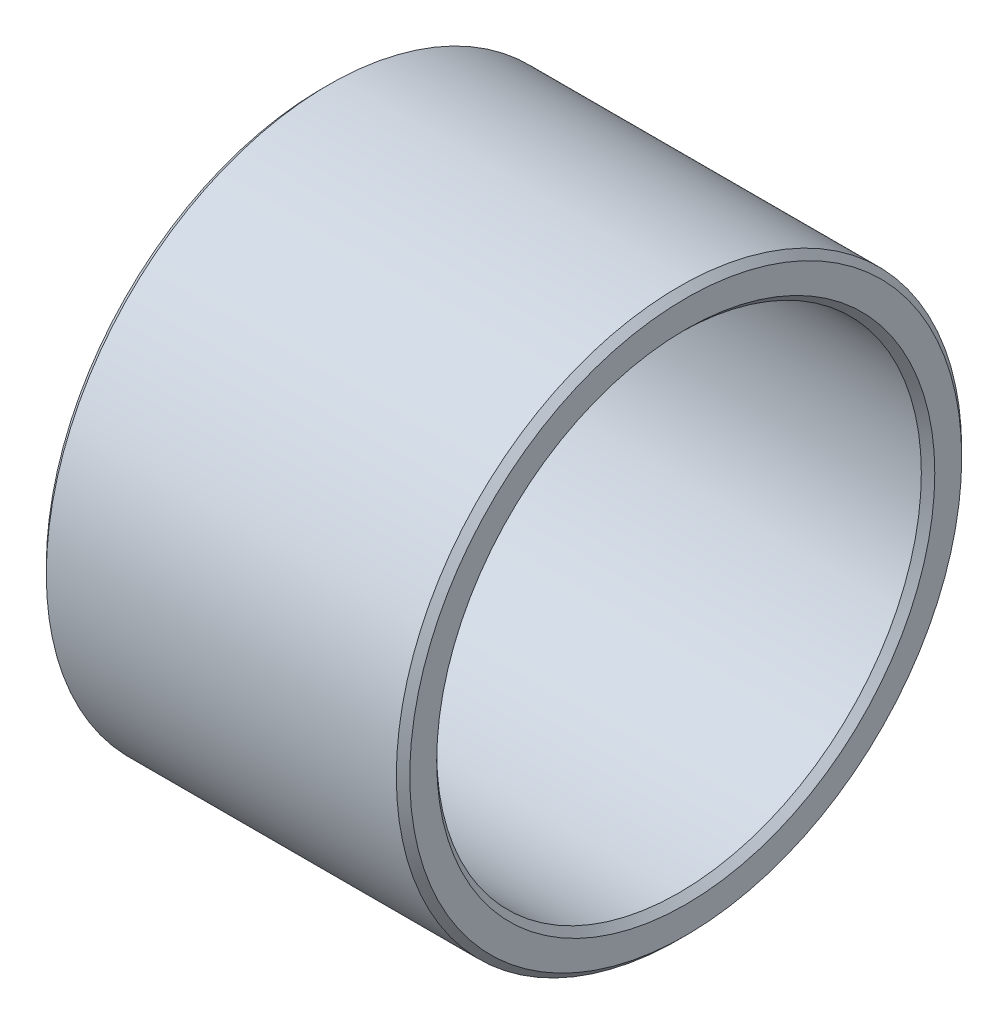
ISO-10303-21;
HEADER;
FILE_DESCRIPTION(('STEP AP214'),'2;1');
FILE_NAME('part.step','',(''),(''),'','','');
FILE_SCHEMA(('AUTOMOTIVE_DESIGN { 1 0 10303 214 1 1 1 1 }'));
ENDSEC;
DATA;
#1=APPLICATION_CONTEXT('core data for automotive mechanical design processes');
#2=APPLICATION_PROTOCOL_DEFINITION('international standard','automotive_design',2000,#1);
#3=PRODUCT_CONTEXT('',#1,'mechanical');
#4=PRODUCT('Part','Part','',(#3));
#5=PRODUCT_RELATED_PRODUCT_CATEGORY('part','',(#4));
#6=PRODUCT_DEFINITION_FORMATION('','',#4);
#7=PRODUCT_DEFINITION_CONTEXT('part definition',#1,'design');
#8=PRODUCT_DEFINITION('design','',#6,#7);
#9=PRODUCT_DEFINITION_SHAPE('','',#8);
#10=(LENGTH_UNIT() NAMED_UNIT(*) SI_UNIT(.MILLI.,.METRE.));
#11=(NAMED_UNIT(*) PLANE_ANGLE_UNIT() SI_UNIT($,.RADIAN.));
#12=(NAMED_UNIT(*) SI_UNIT($,.STERADIAN.) SOLID_ANGLE_UNIT());
#13=UNCERTAINTY_MEASURE_WITH_UNIT(LENGTH_MEASURE(1.E-05),#10,'distance_accuracy_value','');
#14=(GEOMETRIC_REPRESENTATION_CONTEXT(3) GLOBAL_UNCERTAINTY_ASSIGNED_CONTEXT((#13)) GLOBAL_UNIT_ASSIGNED_CONTEXT((#10,
#11,#12)) REPRESENTATION_CONTEXT('',''));
#15=CARTESIAN_POINT('',(0.,0.,0.));
#16=DIRECTION('',(0.,0.,1.));
#17=DIRECTION('',(1.,0.,0.));
#18=AXIS2_PLACEMENT_3D('',#15,#16,#17);
#19=CARTESIAN_POINT('',(-63.2450777037237,-0.830553033493768,57.3794442447024));
#20=DIRECTION('',(-1.,0.,0.));
#21=DIRECTION('',(0.,0.,1.));
#22=AXIS2_PLACEMENT_3D('',#19,#20,#21);
#23=PLANE('',#22);
#24=CARTESIAN_POINT('',(-63.2450777037237,-0.762059862336083,78.3793325464419));
#25=DIRECTION('',(-1.,0.,0.));
#26=DIRECTION('',(0.,0.,1.));
#27=AXIS2_PLACEMENT_3D('',#24,#25,#26);
#28=CIRCLE('',#27,20.5000000000007);
#29=CARTESIAN_POINT('',(-63.2450777037237,-0.762059862336083,98.8793325464426));
#30=VERTEX_POINT('',#29);
#31=EDGE_CURVE('E58',#30,#30,#28,.T.);
#32=ORIENTED_EDGE('',*,*,#31,.T.);
#33=EDGE_LOOP('',(#32));
#34=FACE_BOUND('',#33,.T.);
#35=CARTESIAN_POINT('',(-63.2450777037237,-0.762059862336083,78.3793325464419));
#36=DIRECTION('',(-1.,0.,0.));
#37=DIRECTION('',(0.,0.,1.));
#38=AXIS2_PLACEMENT_3D('',#35,#36,#37);
#39=CIRCLE('',#38,18.5000000000006);
#40=CARTESIAN_POINT('',(-63.2450777037237,-0.762059862336083,96.8793325464425));
#41=VERTEX_POINT('',#40);
#42=EDGE_CURVE('E61',#41,#41,#39,.F.);
#43=ORIENTED_EDGE('',*,*,#42,.T.);
#44=EDGE_LOOP('',(#43));
#45=FACE_BOUND('',#44,.T.);
#46=ADVANCED_FACE('F32',(#34,#45),#23,.T.);
#47=CARTESIAN_POINT('',(-153.375983394243,-0.762059862336083,78.3793325464419));
#48=DIRECTION('',(-1.,0.,0.));
#49=DIRECTION('',(0.,0.,1.));
#50=AXIS2_PLACEMENT_3D('',#47,#48,#49);
#51=CYLINDRICAL_SURFACE('',#50,18.0000000000006);
#52=CARTESIAN_POINT('',(-62.7450777037237,-0.762059862336083,78.3793325464419));
#53=DIRECTION('',(-1.,0.,0.));
#54=DIRECTION('',(0.,0.,1.));
#55=AXIS2_PLACEMENT_3D('',#52,#53,#54);
#56=CIRCLE('',#55,18.0000000000006);
#57=CARTESIAN_POINT('',(-62.7450777037237,-0.762059862336083,96.3793325464425));
#58=VERTEX_POINT('',#57);
#59=EDGE_CURVE('E43',#58,#58,#56,.T.);
#60=ORIENTED_EDGE('',*,*,#59,.T.);
#61=EDGE_LOOP('',(#60));
#62=FACE_BOUND('',#61,.T.);
#63=CARTESIAN_POINT('',(-36.7450777037235,-0.762059862336083,78.3793325464419));
#64=DIRECTION('',(1.,0.,0.));
#65=DIRECTION('',(0.,0.,-1.));
#66=AXIS2_PLACEMENT_3D('',#63,#64,#65);
#67=CIRCLE('',#66,18.0000000000006);
#68=CARTESIAN_POINT('',(-36.7450777037235,-0.762059862336083,60.3793325464413));
#69=VERTEX_POINT('',#68);
#70=EDGE_CURVE('E47',#69,#69,#67,.T.);
#71=ORIENTED_EDGE('',*,*,#70,.T.);
#72=EDGE_LOOP('',(#71));
#73=FACE_BOUND('',#72,.T.);
#74=ADVANCED_FACE('F74',(#62,#73),#51,.F.);
#75=CARTESIAN_POINT('',(-36.2450777037235,-0.830553033493768,57.3794442447024));
#76=DIRECTION('',(1.,0.,0.));
#77=DIRECTION('',(0.,0.,-1.));
#78=AXIS2_PLACEMENT_3D('',#75,#76,#77);
#79=PLANE('',#78);
#80=CARTESIAN_POINT('',(-36.2450777037235,-0.762059862336083,78.3793325464419));
#81=DIRECTION('',(1.,0.,0.));
#82=DIRECTION('',(0.,0.,-1.));
#83=AXIS2_PLACEMENT_3D('',#80,#81,#82);
#84=CIRCLE('',#83,18.5000000000006);
#85=CARTESIAN_POINT('',(-36.2450777037235,-0.762059862336083,59.8793325464413));
#86=VERTEX_POINT('',#85);
#87=EDGE_CURVE('E10',#86,#86,#84,.F.);
#88=ORIENTED_EDGE('',*,*,#87,.T.);
#89=EDGE_LOOP('',(#88));
#90=FACE_BOUND('',#89,.T.);
#91=CARTESIAN_POINT('',(-36.2450777037235,-0.762059862336083,78.3793325464419));
#92=DIRECTION('',(1.,0.,0.));
#93=DIRECTION('',(0.,0.,-1.));
#94=AXIS2_PLACEMENT_3D('',#91,#92,#93);
#95=CIRCLE('',#94,20.5000000000007);
#96=CARTESIAN_POINT('',(-36.2450777037235,-0.762059862336083,57.8793325464412));
#97=VERTEX_POINT('',#96);
#98=EDGE_CURVE('E39',#97,#97,#95,.T.);
#99=ORIENTED_EDGE('',*,*,#98,.T.);
#100=EDGE_LOOP('',(#99));
#101=FACE_BOUND('',#100,.T.);
#102=ADVANCED_FACE('F77',(#90,#101),#79,.T.);
#103=CARTESIAN_POINT('',(-153.375983394243,-0.762059862336083,78.3793325464419));
#104=DIRECTION('',(-1.,0.,0.));
#105=DIRECTION('',(0.,0.,1.));
#106=AXIS2_PLACEMENT_3D('',#103,#104,#105);
#107=CYLINDRICAL_SURFACE('',#106,21.0000000000007);
#108=CARTESIAN_POINT('',(-62.7450777037237,-0.762059862336083,78.3793325464419));
#109=DIRECTION('',(-1.,0.,0.));
#110=DIRECTION('',(0.,0.,1.));
#111=AXIS2_PLACEMENT_3D('',#108,#109,#110);
#112=CIRCLE('',#111,21.0000000000007);
#113=CARTESIAN_POINT('',(-62.7450777037237,-0.762059862336083,99.3793325464426));
#114=VERTEX_POINT('',#113);
#115=EDGE_CURVE('E52',#114,#114,#112,.F.);
#116=ORIENTED_EDGE('',*,*,#115,.T.);
#117=EDGE_LOOP('',(#116));
#118=FACE_BOUND('',#117,.T.);
#119=CARTESIAN_POINT('',(-36.7450777037235,-0.762059862336083,78.3793325464419));
#120=DIRECTION('',(1.,0.,0.));
#121=DIRECTION('',(0.,0.,-1.));
#122=AXIS2_PLACEMENT_3D('',#119,#120,#121);
#123=CIRCLE('',#122,21.0000000000007);
#124=CARTESIAN_POINT('',(-36.7450777037235,-0.762059862336083,57.3793325464412));
#125=VERTEX_POINT('',#124);
#126=EDGE_CURVE('E55',#125,#125,#123,.F.);
#127=ORIENTED_EDGE('',*,*,#126,.T.);
#128=EDGE_LOOP('',(#127));
#129=FACE_BOUND('',#128,.T.);
#130=ADVANCED_FACE('F95',(#118,#129),#107,.T.);
#131=CARTESIAN_POINT('',(-63.2450777037237,-0.762059862336083,78.3793325464419));
#132=DIRECTION('',(1.,0.,0.));
#133=DIRECTION('',(0.,0.,-1.));
#134=AXIS2_PLACEMENT_3D('',#131,#132,#133);
#135=CONICAL_SURFACE('',#134,20.5000000000007,0.785398163397455);
#136=ORIENTED_EDGE('',*,*,#115,.F.);
#137=EDGE_LOOP('',(#136));
#138=FACE_BOUND('',#137,.T.);
#139=ORIENTED_EDGE('',*,*,#31,.F.);
#140=EDGE_LOOP('',(#139));
#141=FACE_BOUND('',#140,.T.);
#142=ADVANCED_FACE('F70',(#138,#141),#135,.T.);
#143=CARTESIAN_POINT('',(-62.7450777037237,-0.762059862336083,78.3793325464419));
#144=DIRECTION('',(-1.,0.,0.));
#145=DIRECTION('',(0.,0.,1.));
#146=AXIS2_PLACEMENT_3D('',#143,#144,#145);
#147=CONICAL_SURFACE('',#146,18.0000000000006,0.785398163397445);
#148=ORIENTED_EDGE('',*,*,#42,.F.);
#149=EDGE_LOOP('',(#148));
#150=FACE_BOUND('',#149,.T.);
#151=ORIENTED_EDGE('',*,*,#59,.F.);
#152=EDGE_LOOP('',(#151));
#153=FACE_BOUND('',#152,.T.);
#154=ADVANCED_FACE('F66',(#150,#153),#147,.F.);
#155=CARTESIAN_POINT('',(-36.2450777037235,-0.762059862336083,78.3793325464419));
#156=DIRECTION('',(1.,0.,0.));
#157=DIRECTION('',(0.,0.,-1.));
#158=AXIS2_PLACEMENT_3D('',#155,#156,#157);
#159=CONICAL_SURFACE('',#158,18.5000000000006,0.785398163397445);
#160=ORIENTED_EDGE('',*,*,#70,.F.);
#161=EDGE_LOOP('',(#160));
#162=FACE_BOUND('',#161,.T.);
#163=ORIENTED_EDGE('',*,*,#87,.F.);
#164=EDGE_LOOP('',(#163));
#165=FACE_BOUND('',#164,.T.);
#166=ADVANCED_FACE('F69',(#162,#165),#159,.F.);
#167=CARTESIAN_POINT('',(-36.7450777037235,-0.762059862336083,78.3793325464419));
#168=DIRECTION('',(-1.,0.,0.));
#169=DIRECTION('',(0.,0.,1.));
#170=AXIS2_PLACEMENT_3D('',#167,#168,#169);
#171=CONICAL_SURFACE('',#170,21.0000000000007,0.785398163397455);
#172=ORIENTED_EDGE('',*,*,#98,.F.);
#173=EDGE_LOOP('',(#172));
#174=FACE_BOUND('',#173,.T.);
#175=ORIENTED_EDGE('',*,*,#126,.F.);
#176=EDGE_LOOP('',(#175));
#177=FACE_BOUND('',#176,.T.);
#178=ADVANCED_FACE('F34',(#174,#177),#171,.T.);
#179=CLOSED_SHELL('',(#46,#74,#102,#130,#142,#154,#166,#178));
#180=MANIFOLD_SOLID_BREP('B2',#179);
#181=ADVANCED_BREP_SHAPE_REPRESENTATION('',(#18,#180),#14);
#182=SHAPE_DEFINITION_REPRESENTATION(#9,#181);
ENDSEC;
END-ISO-10303-21;
